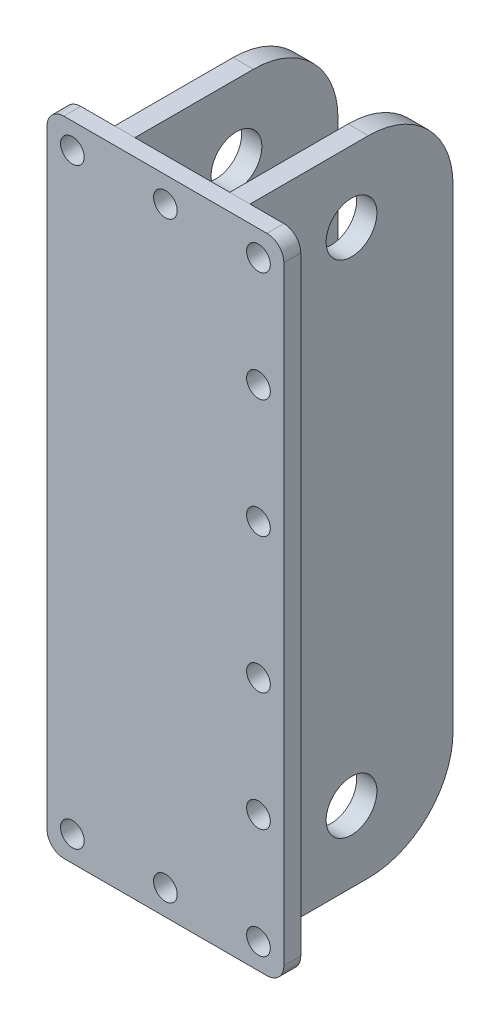
ISO-10303-21;
HEADER;
FILE_DESCRIPTION(('STEP AP214'),'2;1');
FILE_NAME('part.step','',(''),(''),'','','');
FILE_SCHEMA(('AUTOMOTIVE_DESIGN { 1 0 10303 214 1 1 1 1 }'));
ENDSEC;
DATA;
#1=APPLICATION_CONTEXT('core data for automotive mechanical design processes');
#2=APPLICATION_PROTOCOL_DEFINITION('international standard','automotive_design',2000,#1);
#3=PRODUCT_CONTEXT('',#1,'mechanical');
#4=PRODUCT('Part','Part','',(#3));
#5=PRODUCT_RELATED_PRODUCT_CATEGORY('part','',(#4));
#6=PRODUCT_DEFINITION_FORMATION('','',#4);
#7=PRODUCT_DEFINITION_CONTEXT('part definition',#1,'design');
#8=PRODUCT_DEFINITION('design','',#6,#7);
#9=PRODUCT_DEFINITION_SHAPE('','',#8);
#10=(LENGTH_UNIT() NAMED_UNIT(*) SI_UNIT(.MILLI.,.METRE.));
#11=(NAMED_UNIT(*) PLANE_ANGLE_UNIT() SI_UNIT($,.RADIAN.));
#12=(NAMED_UNIT(*) SI_UNIT($,.STERADIAN.) SOLID_ANGLE_UNIT());
#13=UNCERTAINTY_MEASURE_WITH_UNIT(LENGTH_MEASURE(1.E-05),#10,'distance_accuracy_value','');
#14=(GEOMETRIC_REPRESENTATION_CONTEXT(3) GLOBAL_UNCERTAINTY_ASSIGNED_CONTEXT((#13)) GLOBAL_UNIT_ASSIGNED_CONTEXT((#10,
#11,#12)) REPRESENTATION_CONTEXT('',''));
#15=CARTESIAN_POINT('',(0.,0.,0.));
#16=DIRECTION('',(0.,0.,1.));
#17=DIRECTION('',(1.,0.,0.));
#18=AXIS2_PLACEMENT_3D('',#15,#16,#17);
#19=CARTESIAN_POINT('',(42.,380.,-120.));
#20=DIRECTION('',(-1.,0.,0.));
#21=DIRECTION('',(0.,-1.,0.));
#22=AXIS2_PLACEMENT_3D('',#19,#20,#21);
#23=PLANE('',#22);
#24=CARTESIAN_POINT('',(42.,338.,-60.));
#25=DIRECTION('',(-1.,0.,0.));
#26=DIRECTION('',(0.,-1.,0.));
#27=AXIS2_PLACEMENT_3D('',#24,#25,#26);
#28=CIRCLE('',#27,15.);
#29=CARTESIAN_POINT('',(42.,323.,-60.));
#30=VERTEX_POINT('',#29);
#31=EDGE_CURVE('E116',#30,#30,#28,.F.);
#32=ORIENTED_EDGE('',*,*,#31,.F.);
#33=EDGE_LOOP('',(#32));
#34=FACE_BOUND('',#33,.T.);
#35=CARTESIAN_POINT('',(41.9999999999999,42.,-59.9999999999999));
#36=DIRECTION('',(-1.,0.,0.));
#37=DIRECTION('',(0.,-1.,0.));
#38=AXIS2_PLACEMENT_3D('',#35,#36,#37);
#39=CIRCLE('',#38,15.);
#40=CARTESIAN_POINT('',(41.9999999999999,27.,-59.9999999999999));
#41=VERTEX_POINT('',#40);
#42=EDGE_CURVE('E199',#41,#41,#39,.F.);
#43=ORIENTED_EDGE('',*,*,#42,.F.);
#44=EDGE_LOOP('',(#43));
#45=FACE_BOUND('',#44,.T.);
#46=DIRECTION('',(0.,0.,1.));
#47=VECTOR('',#46,1.);
#48=CARTESIAN_POINT('',(41.9999999999999,0.,-120.));
#49=LINE('',#48,#47);
#50=CARTESIAN_POINT('',(41.9999999999999,0.,-70.));
#51=VERTEX_POINT('',#50);
#52=CARTESIAN_POINT('',(41.9999999999999,0.,0.));
#53=VERTEX_POINT('',#52);
#54=EDGE_CURVE('E96',#51,#53,#49,.T.);
#55=ORIENTED_EDGE('',*,*,#54,.F.);
#56=CARTESIAN_POINT('',(42.,50.,-70.));
#57=DIRECTION('',(-1.,0.,0.));
#58=DIRECTION('',(0.,-1.,0.));
#59=AXIS2_PLACEMENT_3D('',#56,#57,#58);
#60=CIRCLE('',#59,50.);
#61=CARTESIAN_POINT('',(42.,50.,-120.));
#62=VERTEX_POINT('',#61);
#63=EDGE_CURVE('E53',#51,#62,#60,.F.);
#64=ORIENTED_EDGE('',*,*,#63,.T.);
#65=DIRECTION('',(0.,-1.,0.));
#66=VECTOR('',#65,1.);
#67=CARTESIAN_POINT('',(42.,380.,-120.));
#68=LINE('',#67,#66);
#69=CARTESIAN_POINT('',(42.,330.,-120.));
#70=VERTEX_POINT('',#69);
#71=EDGE_CURVE('E128',#70,#62,#68,.T.);
#72=ORIENTED_EDGE('',*,*,#71,.F.);
#73=CARTESIAN_POINT('',(42.,330.,-70.));
#74=DIRECTION('',(-1.,0.,0.));
#75=DIRECTION('',(0.,-1.,0.));
#76=AXIS2_PLACEMENT_3D('',#73,#74,#75);
#77=CIRCLE('',#76,50.);
#78=CARTESIAN_POINT('',(42.,380.,-70.));
#79=VERTEX_POINT('',#78);
#80=EDGE_CURVE('E60',#70,#79,#77,.F.);
#81=ORIENTED_EDGE('',*,*,#80,.T.);
#82=DIRECTION('',(0.,0.,1.));
#83=VECTOR('',#82,1.);
#84=CARTESIAN_POINT('',(42.,380.,-120.));
#85=LINE('',#84,#83);
#86=CARTESIAN_POINT('',(42.,380.,0.));
#87=VERTEX_POINT('',#86);
#88=EDGE_CURVE('E114',#79,#87,#85,.T.);
#89=ORIENTED_EDGE('',*,*,#88,.T.);
#90=DIRECTION('',(0.,-1.,0.));
#91=VECTOR('',#90,1.);
#92=CARTESIAN_POINT('',(42.,380.,0.));
#93=LINE('',#92,#91);
#94=EDGE_CURVE('E110',#87,#53,#93,.T.);
#95=ORIENTED_EDGE('',*,*,#94,.T.);
#96=EDGE_LOOP('',(#55,#64,#72,#81,#89,#95));
#97=FACE_BOUND('',#96,.T.);
#98=ADVANCED_FACE('F45',(#34,#45,#97),#23,.F.);
#99=CARTESIAN_POINT('',(41.9999999999999,0.,-120.));
#100=DIRECTION('',(0.,1.,0.));
#101=DIRECTION('',(-1.,0.,0.));
#102=AXIS2_PLACEMENT_3D('',#99,#100,#101);
#103=PLANE('',#102);
#104=DIRECTION('',(0.,0.,1.));
#105=VECTOR('',#104,1.);
#106=CARTESIAN_POINT('',(30.,0.,-120.));
#107=LINE('',#106,#105);
#108=CARTESIAN_POINT('',(30.,0.,-70.));
#109=VERTEX_POINT('',#108);
#110=CARTESIAN_POINT('',(30.,0.,0.));
#111=VERTEX_POINT('',#110);
#112=EDGE_CURVE('E104',#109,#111,#107,.T.);
#113=ORIENTED_EDGE('',*,*,#112,.F.);
#114=DIRECTION('',(-1.,0.,0.));
#115=VECTOR('',#114,1.);
#116=CARTESIAN_POINT('',(41.9999999999999,0.,-70.));
#117=LINE('',#116,#115);
#118=EDGE_CURVE('E68',#109,#51,#117,.F.);
#119=ORIENTED_EDGE('',*,*,#118,.T.);
#120=ORIENTED_EDGE('',*,*,#54,.T.);
#121=DIRECTION('',(-1.,0.,0.));
#122=VECTOR('',#121,1.);
#123=CARTESIAN_POINT('',(41.9999999999999,0.,0.));
#124=LINE('',#123,#122);
#125=EDGE_CURVE('E99',#53,#111,#124,.T.);
#126=ORIENTED_EDGE('',*,*,#125,.T.);
#127=EDGE_LOOP('',(#113,#119,#120,#126));
#128=FACE_BOUND('',#127,.T.);
#129=ADVANCED_FACE('F98',(#128),#103,.F.);
#130=CARTESIAN_POINT('',(30.,380.,-120.));
#131=DIRECTION('',(1.,0.,0.));
#132=DIRECTION('',(0.,1.,0.));
#133=AXIS2_PLACEMENT_3D('',#130,#131,#132);
#134=PLANE('',#133);
#135=CARTESIAN_POINT('',(30.,338.,-60.));
#136=DIRECTION('',(-1.,0.,0.));
#137=DIRECTION('',(0.,-1.,0.));
#138=AXIS2_PLACEMENT_3D('',#135,#136,#137);
#139=CIRCLE('',#138,15.);
#140=CARTESIAN_POINT('',(30.,323.,-60.));
#141=VERTEX_POINT('',#140);
#142=EDGE_CURVE('E119',#141,#141,#139,.T.);
#143=ORIENTED_EDGE('',*,*,#142,.F.);
#144=EDGE_LOOP('',(#143));
#145=FACE_BOUND('',#144,.T.);
#146=CARTESIAN_POINT('',(30.,42.,-59.9999999999999));
#147=DIRECTION('',(-1.,0.,0.));
#148=DIRECTION('',(0.,-1.,0.));
#149=AXIS2_PLACEMENT_3D('',#146,#147,#148);
#150=CIRCLE('',#149,15.);
#151=CARTESIAN_POINT('',(30.,27.,-59.9999999999999));
#152=VERTEX_POINT('',#151);
#153=EDGE_CURVE('E202',#152,#152,#150,.T.);
#154=ORIENTED_EDGE('',*,*,#153,.F.);
#155=EDGE_LOOP('',(#154));
#156=FACE_BOUND('',#155,.T.);
#157=DIRECTION('',(0.,1.,0.));
#158=VECTOR('',#157,1.);
#159=CARTESIAN_POINT('',(30.,380.,-120.));
#160=LINE('',#159,#158);
#161=CARTESIAN_POINT('',(30.,50.,-120.));
#162=VERTEX_POINT('',#161);
#163=CARTESIAN_POINT('',(30.,330.,-120.));
#164=VERTEX_POINT('',#163);
#165=EDGE_CURVE('E122',#162,#164,#160,.T.);
#166=ORIENTED_EDGE('',*,*,#165,.F.);
#167=CARTESIAN_POINT('',(30.,50.,-70.));
#168=DIRECTION('',(1.,0.,0.));
#169=DIRECTION('',(0.,1.,0.));
#170=AXIS2_PLACEMENT_3D('',#167,#168,#169);
#171=CIRCLE('',#170,50.);
#172=EDGE_CURVE('E140',#162,#109,#171,.F.);
#173=ORIENTED_EDGE('',*,*,#172,.T.);
#174=ORIENTED_EDGE('',*,*,#112,.T.);
#175=DIRECTION('',(0.,1.,0.));
#176=VECTOR('',#175,1.);
#177=CARTESIAN_POINT('',(30.,380.,0.));
#178=LINE('',#177,#176);
#179=CARTESIAN_POINT('',(30.,380.,0.));
#180=VERTEX_POINT('',#179);
#181=EDGE_CURVE('E112',#111,#180,#178,.T.);
#182=ORIENTED_EDGE('',*,*,#181,.T.);
#183=DIRECTION('',(0.,0.,1.));
#184=VECTOR('',#183,1.);
#185=CARTESIAN_POINT('',(30.,380.,-120.));
#186=LINE('',#185,#184);
#187=CARTESIAN_POINT('',(30.,380.,-70.));
#188=VERTEX_POINT('',#187);
#189=EDGE_CURVE('E130',#188,#180,#186,.T.);
#190=ORIENTED_EDGE('',*,*,#189,.F.);
#191=CARTESIAN_POINT('',(30.,330.,-70.));
#192=DIRECTION('',(1.,0.,0.));
#193=DIRECTION('',(0.,1.,0.));
#194=AXIS2_PLACEMENT_3D('',#191,#192,#193);
#195=CIRCLE('',#194,50.);
#196=EDGE_CURVE('E138',#188,#164,#195,.F.);
#197=ORIENTED_EDGE('',*,*,#196,.T.);
#198=EDGE_LOOP('',(#166,#173,#174,#182,#190,#197));
#199=FACE_BOUND('',#198,.T.);
#200=ADVANCED_FACE('F153',(#145,#156,#199),#134,.F.);
#201=CARTESIAN_POINT('',(42.,380.,-120.));
#202=DIRECTION('',(0.,-1.,0.));
#203=DIRECTION('',(0.,0.,-1.));
#204=AXIS2_PLACEMENT_3D('',#201,#202,#203);
#205=PLANE('',#204);
#206=ORIENTED_EDGE('',*,*,#88,.F.);
#207=DIRECTION('',(1.,0.,0.));
#208=VECTOR('',#207,1.);
#209=CARTESIAN_POINT('',(30.,380.,-70.));
#210=LINE('',#209,#208);
#211=EDGE_CURVE('E12',#79,#188,#210,.F.);
#212=ORIENTED_EDGE('',*,*,#211,.T.);
#213=ORIENTED_EDGE('',*,*,#189,.T.);
#214=DIRECTION('',(1.,0.,0.));
#215=VECTOR('',#214,1.);
#216=CARTESIAN_POINT('',(42.,380.,0.));
#217=LINE('',#216,#215);
#218=EDGE_CURVE('E126',#180,#87,#217,.T.);
#219=ORIENTED_EDGE('',*,*,#218,.T.);
#220=EDGE_LOOP('',(#206,#212,#213,#219));
#221=FACE_BOUND('',#220,.T.);
#222=ADVANCED_FACE('F159',(#221),#205,.F.);
#223=CARTESIAN_POINT('',(0.,0.,-120.));
#224=DIRECTION('',(0.,0.,-1.));
#225=DIRECTION('',(-1.,0.,0.));
#226=AXIS2_PLACEMENT_3D('',#223,#224,#225);
#227=PLANE('',#226);
#228=ORIENTED_EDGE('',*,*,#71,.T.);
#229=DIRECTION('',(-1.,0.,0.));
#230=VECTOR('',#229,1.);
#231=CARTESIAN_POINT('',(30.,50.,-120.));
#232=LINE('',#231,#230);
#233=EDGE_CURVE('E135',#62,#162,#232,.T.);
#234=ORIENTED_EDGE('',*,*,#233,.T.);
#235=ORIENTED_EDGE('',*,*,#165,.T.);
#236=DIRECTION('',(1.,0.,0.));
#237=VECTOR('',#236,1.);
#238=CARTESIAN_POINT('',(42.,330.,-120.));
#239=LINE('',#238,#237);
#240=EDGE_CURVE('E103',#164,#70,#239,.T.);
#241=ORIENTED_EDGE('',*,*,#240,.T.);
#242=EDGE_LOOP('',(#228,#234,#235,#241));
#243=FACE_BOUND('',#242,.T.);
#244=ADVANCED_FACE('F147',(#243),#227,.T.);
#245=CARTESIAN_POINT('',(0.,0.,0.));
#246=DIRECTION('',(0.,0.,-1.));
#247=DIRECTION('',(-1.,0.,0.));
#248=AXIS2_PLACEMENT_3D('',#245,#246,#247);
#249=PLANE('',#248);
#250=ORIENTED_EDGE('',*,*,#94,.F.);
#251=ORIENTED_EDGE('',*,*,#218,.F.);
#252=ORIENTED_EDGE('',*,*,#181,.F.);
#253=ORIENTED_EDGE('',*,*,#125,.F.);
#254=EDGE_LOOP('',(#250,#251,#252,#253));
#255=FACE_BOUND('',#254,.T.);
#256=ADVANCED_FACE('F108',(#255),#249,.F.);
#257=CARTESIAN_POINT('',(0.,50.,-70.));
#258=DIRECTION('',(1.,0.,0.));
#259=DIRECTION('',(0.,1.,0.));
#260=AXIS2_PLACEMENT_3D('',#257,#258,#259);
#261=CYLINDRICAL_SURFACE('',#260,50.);
#262=ORIENTED_EDGE('',*,*,#63,.F.);
#263=ORIENTED_EDGE('',*,*,#118,.F.);
#264=ORIENTED_EDGE('',*,*,#172,.F.);
#265=ORIENTED_EDGE('',*,*,#233,.F.);
#266=EDGE_LOOP('',(#262,#263,#264,#265));
#267=FACE_BOUND('',#266,.T.);
#268=ADVANCED_FACE('F151',(#267),#261,.T.);
#269=CARTESIAN_POINT('',(0.,330.,-70.));
#270=DIRECTION('',(-1.,0.,0.));
#271=DIRECTION('',(0.,0.,1.));
#272=AXIS2_PLACEMENT_3D('',#269,#270,#271);
#273=CYLINDRICAL_SURFACE('',#272,50.);
#274=ORIENTED_EDGE('',*,*,#196,.F.);
#275=ORIENTED_EDGE('',*,*,#211,.F.);
#276=ORIENTED_EDGE('',*,*,#80,.F.);
#277=ORIENTED_EDGE('',*,*,#240,.F.);
#278=EDGE_LOOP('',(#274,#275,#276,#277));
#279=FACE_BOUND('',#278,.T.);
#280=ADVANCED_FACE('F47',(#279),#273,.T.);
#281=CARTESIAN_POINT('',(140.001,42.,-59.9999999999999));
#282=DIRECTION('',(-1.,0.,0.));
#283=DIRECTION('',(0.,-1.,0.));
#284=AXIS2_PLACEMENT_3D('',#281,#282,#283);
#285=CYLINDRICAL_SURFACE('',#284,15.);
#286=ORIENTED_EDGE('',*,*,#153,.T.);
#287=EDGE_LOOP('',(#286));
#288=FACE_BOUND('',#287,.T.);
#289=ORIENTED_EDGE('',*,*,#42,.T.);
#290=EDGE_LOOP('',(#289));
#291=FACE_BOUND('',#290,.T.);
#292=ADVANCED_FACE('F184',(#288,#291),#285,.F.);
#293=CARTESIAN_POINT('',(140.001,338.,-60.));
#294=DIRECTION('',(-1.,0.,0.));
#295=DIRECTION('',(0.,-1.,0.));
#296=AXIS2_PLACEMENT_3D('',#293,#294,#295);
#297=CYLINDRICAL_SURFACE('',#296,15.);
#298=ORIENTED_EDGE('',*,*,#142,.T.);
#299=EDGE_LOOP('',(#298));
#300=FACE_BOUND('',#299,.T.);
#301=ORIENTED_EDGE('',*,*,#31,.T.);
#302=EDGE_LOOP('',(#301));
#303=FACE_BOUND('',#302,.T.);
#304=ADVANCED_FACE('F190',(#300,#303),#297,.F.);
#305=CLOSED_SHELL('',(#98,#129,#200,#222,#244,#256,#268,#280,#292,#304));
#306=MANIFOLD_SOLID_BREP('B2',#305);
#307=CARTESIAN_POINT('',(110.,380.,-120.));
#308=DIRECTION('',(-1.,0.,0.));
#309=DIRECTION('',(0.,-1.,0.));
#310=AXIS2_PLACEMENT_3D('',#307,#308,#309);
#311=PLANE('',#310);
#312=CARTESIAN_POINT('',(110.,338.,-60.));
#313=DIRECTION('',(1.,0.,0.));
#314=DIRECTION('',(0.,1.,0.));
#315=AXIS2_PLACEMENT_3D('',#312,#313,#314);
#316=CIRCLE('',#315,15.);
#317=CARTESIAN_POINT('',(110.,353.,-60.));
#318=VERTEX_POINT('',#317);
#319=EDGE_CURVE('E350',#318,#318,#316,.T.);
#320=ORIENTED_EDGE('',*,*,#319,.F.);
#321=EDGE_LOOP('',(#320));
#322=FACE_BOUND('',#321,.T.);
#323=CARTESIAN_POINT('',(110.,42.,-60.0000000000001));
#324=DIRECTION('',(1.,0.,0.));
#325=DIRECTION('',(0.,1.,0.));
#326=AXIS2_PLACEMENT_3D('',#323,#324,#325);
#327=CIRCLE('',#326,15.);
#328=CARTESIAN_POINT('',(110.,57.,-60.0000000000001));
#329=VERTEX_POINT('',#328);
#330=EDGE_CURVE('E390',#329,#329,#327,.T.);
#331=ORIENTED_EDGE('',*,*,#330,.F.);
#332=EDGE_LOOP('',(#331));
#333=FACE_BOUND('',#332,.T.);
#334=DIRECTION('',(0.,-1.,0.));
#335=VECTOR('',#334,1.);
#336=CARTESIAN_POINT('',(110.,380.,-120.));
#337=LINE('',#336,#335);
#338=CARTESIAN_POINT('',(110.,330.,-120.));
#339=VERTEX_POINT('',#338);
#340=CARTESIAN_POINT('',(110.,50.,-120.));
#341=VERTEX_POINT('',#340);
#342=EDGE_CURVE('E359',#339,#341,#337,.T.);
#343=ORIENTED_EDGE('',*,*,#342,.F.);
#344=CARTESIAN_POINT('',(110.,330.,-70.));
#345=DIRECTION('',(-1.,0.,0.));
#346=DIRECTION('',(0.,-1.,0.));
#347=AXIS2_PLACEMENT_3D('',#344,#345,#346);
#348=CIRCLE('',#347,50.);
#349=CARTESIAN_POINT('',(110.,380.,-70.));
#350=VERTEX_POINT('',#349);
#351=EDGE_CURVE('E371',#339,#350,#348,.F.);
#352=ORIENTED_EDGE('',*,*,#351,.T.);
#353=DIRECTION('',(0.,0.,1.));
#354=VECTOR('',#353,1.);
#355=CARTESIAN_POINT('',(110.,380.,-120.));
#356=LINE('',#355,#354);
#357=CARTESIAN_POINT('',(110.,380.,0.));
#358=VERTEX_POINT('',#357);
#359=EDGE_CURVE('E345',#350,#358,#356,.T.);
#360=ORIENTED_EDGE('',*,*,#359,.T.);
#361=DIRECTION('',(0.,-1.,0.));
#362=VECTOR('',#361,1.);
#363=CARTESIAN_POINT('',(110.,380.,0.));
#364=LINE('',#363,#362);
#365=CARTESIAN_POINT('',(110.,0.,0.));
#366=VERTEX_POINT('',#365);
#367=EDGE_CURVE('E340',#358,#366,#364,.T.);
#368=ORIENTED_EDGE('',*,*,#367,.T.);
#369=DIRECTION('',(0.,0.,1.));
#370=VECTOR('',#369,1.);
#371=CARTESIAN_POINT('',(110.,0.,-120.));
#372=LINE('',#371,#370);
#373=CARTESIAN_POINT('',(110.,0.,-70.));
#374=VERTEX_POINT('',#373);
#375=EDGE_CURVE('E324',#374,#366,#372,.T.);
#376=ORIENTED_EDGE('',*,*,#375,.F.);
#377=CARTESIAN_POINT('',(110.,50.,-70.));
#378=DIRECTION('',(-1.,0.,0.));
#379=DIRECTION('',(0.,-1.,0.));
#380=AXIS2_PLACEMENT_3D('',#377,#378,#379);
#381=CIRCLE('',#380,50.);
#382=EDGE_CURVE('E369',#374,#341,#381,.F.);
#383=ORIENTED_EDGE('',*,*,#382,.T.);
#384=EDGE_LOOP('',(#343,#352,#360,#368,#376,#383));
#385=FACE_BOUND('',#384,.T.);
#386=ADVANCED_FACE('F271',(#322,#333,#385),#311,.F.);
#387=CARTESIAN_POINT('',(110.,0.,-120.));
#388=DIRECTION('',(0.,1.,0.));
#389=DIRECTION('',(0.,0.,1.));
#390=AXIS2_PLACEMENT_3D('',#387,#388,#389);
#391=PLANE('',#390);
#392=DIRECTION('',(0.,0.,1.));
#393=VECTOR('',#392,1.);
#394=CARTESIAN_POINT('',(98.,0.,-120.));
#395=LINE('',#394,#393);
#396=CARTESIAN_POINT('',(98.,0.,-70.));
#397=VERTEX_POINT('',#396);
#398=CARTESIAN_POINT('',(98.,0.,0.));
#399=VERTEX_POINT('',#398);
#400=EDGE_CURVE('E334',#397,#399,#395,.T.);
#401=ORIENTED_EDGE('',*,*,#400,.F.);
#402=DIRECTION('',(-1.,0.,0.));
#403=VECTOR('',#402,1.);
#404=CARTESIAN_POINT('',(110.,0.,-70.));
#405=LINE('',#404,#403);
#406=EDGE_CURVE('E43',#397,#374,#405,.F.);
#407=ORIENTED_EDGE('',*,*,#406,.T.);
#408=ORIENTED_EDGE('',*,*,#375,.T.);
#409=DIRECTION('',(-1.,0.,0.));
#410=VECTOR('',#409,1.);
#411=CARTESIAN_POINT('',(110.,0.,0.));
#412=LINE('',#411,#410);
#413=EDGE_CURVE('E327',#366,#399,#412,.T.);
#414=ORIENTED_EDGE('',*,*,#413,.T.);
#415=EDGE_LOOP('',(#401,#407,#408,#414));
#416=FACE_BOUND('',#415,.T.);
#417=ADVANCED_FACE('F326',(#416),#391,.F.);
#418=CARTESIAN_POINT('',(98.,380.,-120.));
#419=DIRECTION('',(1.,0.,0.));
#420=DIRECTION('',(0.,1.,0.));
#421=AXIS2_PLACEMENT_3D('',#418,#419,#420);
#422=PLANE('',#421);
#423=CARTESIAN_POINT('',(98.,338.,-60.));
#424=DIRECTION('',(1.,0.,0.));
#425=DIRECTION('',(0.,1.,0.));
#426=AXIS2_PLACEMENT_3D('',#423,#424,#425);
#427=CIRCLE('',#426,15.);
#428=CARTESIAN_POINT('',(98.,353.,-60.));
#429=VERTEX_POINT('',#428);
#430=EDGE_CURVE('E347',#429,#429,#427,.F.);
#431=ORIENTED_EDGE('',*,*,#430,.F.);
#432=EDGE_LOOP('',(#431));
#433=FACE_BOUND('',#432,.T.);
#434=CARTESIAN_POINT('',(98.,42.,-60.0000000000001));
#435=DIRECTION('',(1.,0.,0.));
#436=DIRECTION('',(0.,1.,0.));
#437=AXIS2_PLACEMENT_3D('',#434,#435,#436);
#438=CIRCLE('',#437,15.);
#439=CARTESIAN_POINT('',(98.,57.,-60.0000000000001));
#440=VERTEX_POINT('',#439);
#441=EDGE_CURVE('E387',#440,#440,#438,.F.);
#442=ORIENTED_EDGE('',*,*,#441,.F.);
#443=EDGE_LOOP('',(#442));
#444=FACE_BOUND('',#443,.T.);
#445=DIRECTION('',(0.,0.,1.));
#446=VECTOR('',#445,1.);
#447=CARTESIAN_POINT('',(98.,380.,-120.));
#448=LINE('',#447,#446);
#449=CARTESIAN_POINT('',(98.,380.,-70.));
#450=VERTEX_POINT('',#449);
#451=CARTESIAN_POINT('',(98.,380.,0.));
#452=VERTEX_POINT('',#451);
#453=EDGE_CURVE('E361',#450,#452,#448,.T.);
#454=ORIENTED_EDGE('',*,*,#453,.F.);
#455=CARTESIAN_POINT('',(98.,330.,-70.));
#456=DIRECTION('',(1.,0.,0.));
#457=DIRECTION('',(0.,1.,0.));
#458=AXIS2_PLACEMENT_3D('',#455,#456,#457);
#459=CIRCLE('',#458,50.);
#460=CARTESIAN_POINT('',(98.,330.,-120.));
#461=VERTEX_POINT('',#460);
#462=EDGE_CURVE('E279',#450,#461,#459,.F.);
#463=ORIENTED_EDGE('',*,*,#462,.T.);
#464=DIRECTION('',(0.,1.,0.));
#465=VECTOR('',#464,1.);
#466=CARTESIAN_POINT('',(98.,380.,-120.));
#467=LINE('',#466,#465);
#468=CARTESIAN_POINT('',(98.,50.,-120.));
#469=VERTEX_POINT('',#468);
#470=EDGE_CURVE('E353',#469,#461,#467,.T.);
#471=ORIENTED_EDGE('',*,*,#470,.F.);
#472=CARTESIAN_POINT('',(98.,50.,-70.));
#473=DIRECTION('',(1.,0.,0.));
#474=DIRECTION('',(0.,1.,0.));
#475=AXIS2_PLACEMENT_3D('',#472,#473,#474);
#476=CIRCLE('',#475,50.);
#477=EDGE_CURVE('E286',#469,#397,#476,.F.);
#478=ORIENTED_EDGE('',*,*,#477,.T.);
#479=ORIENTED_EDGE('',*,*,#400,.T.);
#480=DIRECTION('',(0.,1.,0.));
#481=VECTOR('',#480,1.);
#482=CARTESIAN_POINT('',(98.,380.,0.));
#483=LINE('',#482,#481);
#484=EDGE_CURVE('E342',#399,#452,#483,.T.);
#485=ORIENTED_EDGE('',*,*,#484,.T.);
#486=EDGE_LOOP('',(#454,#463,#471,#478,#479,#485));
#487=FACE_BOUND('',#486,.T.);
#488=ADVANCED_FACE('F376',(#433,#444,#487),#422,.F.);
#489=CARTESIAN_POINT('',(110.,380.,-120.));
#490=DIRECTION('',(0.,-1.,0.));
#491=DIRECTION('',(0.,0.,-1.));
#492=AXIS2_PLACEMENT_3D('',#489,#490,#491);
#493=PLANE('',#492);
#494=ORIENTED_EDGE('',*,*,#359,.F.);
#495=DIRECTION('',(1.,0.,0.));
#496=VECTOR('',#495,1.);
#497=CARTESIAN_POINT('',(98.,380.,-70.));
#498=LINE('',#497,#496);
#499=EDGE_CURVE('E294',#350,#450,#498,.F.);
#500=ORIENTED_EDGE('',*,*,#499,.T.);
#501=ORIENTED_EDGE('',*,*,#453,.T.);
#502=DIRECTION('',(1.,0.,0.));
#503=VECTOR('',#502,1.);
#504=CARTESIAN_POINT('',(110.,380.,0.));
#505=LINE('',#504,#503);
#506=EDGE_CURVE('E357',#452,#358,#505,.T.);
#507=ORIENTED_EDGE('',*,*,#506,.T.);
#508=EDGE_LOOP('',(#494,#500,#501,#507));
#509=FACE_BOUND('',#508,.T.);
#510=ADVANCED_FACE('F384',(#509),#493,.F.);
#511=CARTESIAN_POINT('',(0.,0.,-120.));
#512=DIRECTION('',(0.,0.,-1.));
#513=DIRECTION('',(-1.,0.,0.));
#514=AXIS2_PLACEMENT_3D('',#511,#512,#513);
#515=PLANE('',#514);
#516=ORIENTED_EDGE('',*,*,#470,.T.);
#517=DIRECTION('',(1.,0.,0.));
#518=VECTOR('',#517,1.);
#519=CARTESIAN_POINT('',(110.,330.,-120.));
#520=LINE('',#519,#518);
#521=EDGE_CURVE('E366',#461,#339,#520,.T.);
#522=ORIENTED_EDGE('',*,*,#521,.T.);
#523=ORIENTED_EDGE('',*,*,#342,.T.);
#524=DIRECTION('',(-1.,0.,0.));
#525=VECTOR('',#524,1.);
#526=CARTESIAN_POINT('',(98.,50.,-120.));
#527=LINE('',#526,#525);
#528=EDGE_CURVE('E333',#341,#469,#527,.T.);
#529=ORIENTED_EDGE('',*,*,#528,.T.);
#530=EDGE_LOOP('',(#516,#522,#523,#529));
#531=FACE_BOUND('',#530,.T.);
#532=ADVANCED_FACE('F380',(#531),#515,.T.);
#533=CARTESIAN_POINT('',(0.,0.,0.));
#534=DIRECTION('',(0.,0.,-1.));
#535=DIRECTION('',(-1.,0.,0.));
#536=AXIS2_PLACEMENT_3D('',#533,#534,#535);
#537=PLANE('',#536);
#538=ORIENTED_EDGE('',*,*,#367,.F.);
#539=ORIENTED_EDGE('',*,*,#506,.F.);
#540=ORIENTED_EDGE('',*,*,#484,.F.);
#541=ORIENTED_EDGE('',*,*,#413,.F.);
#542=EDGE_LOOP('',(#538,#539,#540,#541));
#543=FACE_BOUND('',#542,.T.);
#544=ADVANCED_FACE('F338',(#543),#537,.F.);
#545=CARTESIAN_POINT('',(0.,330.,-70.));
#546=DIRECTION('',(-1.,0.,0.));
#547=DIRECTION('',(0.,0.,1.));
#548=AXIS2_PLACEMENT_3D('',#545,#546,#547);
#549=CYLINDRICAL_SURFACE('',#548,50.);
#550=ORIENTED_EDGE('',*,*,#462,.F.);
#551=ORIENTED_EDGE('',*,*,#499,.F.);
#552=ORIENTED_EDGE('',*,*,#351,.F.);
#553=ORIENTED_EDGE('',*,*,#521,.F.);
#554=EDGE_LOOP('',(#550,#551,#552,#553));
#555=FACE_BOUND('',#554,.T.);
#556=ADVANCED_FACE('F383',(#555),#549,.T.);
#557=CARTESIAN_POINT('',(0.,50.,-70.));
#558=DIRECTION('',(1.,0.,0.));
#559=DIRECTION('',(0.,0.,-1.));
#560=AXIS2_PLACEMENT_3D('',#557,#558,#559);
#561=CYLINDRICAL_SURFACE('',#560,50.);
#562=ORIENTED_EDGE('',*,*,#382,.F.);
#563=ORIENTED_EDGE('',*,*,#406,.F.);
#564=ORIENTED_EDGE('',*,*,#477,.F.);
#565=ORIENTED_EDGE('',*,*,#528,.F.);
#566=EDGE_LOOP('',(#562,#563,#564,#565));
#567=FACE_BOUND('',#566,.T.);
#568=ADVANCED_FACE('F273',(#567),#561,.T.);
#569=CARTESIAN_POINT('',(-0.00100000000004263,42.,-60.0000000000001));
#570=DIRECTION('',(1.,0.,0.));
#571=DIRECTION('',(0.,1.,0.));
#572=AXIS2_PLACEMENT_3D('',#569,#570,#571);
#573=CYLINDRICAL_SURFACE('',#572,15.);
#574=ORIENTED_EDGE('',*,*,#330,.T.);
#575=EDGE_LOOP('',(#574));
#576=FACE_BOUND('',#575,.T.);
#577=ORIENTED_EDGE('',*,*,#441,.T.);
#578=EDGE_LOOP('',(#577));
#579=FACE_BOUND('',#578,.T.);
#580=ADVANCED_FACE('F404',(#576,#579),#573,.F.);
#581=CARTESIAN_POINT('',(-0.001000000000001,338.,-60.));
#582=DIRECTION('',(1.,0.,0.));
#583=DIRECTION('',(0.,1.,0.));
#584=AXIS2_PLACEMENT_3D('',#581,#582,#583);
#585=CYLINDRICAL_SURFACE('',#584,15.);
#586=ORIENTED_EDGE('',*,*,#319,.T.);
#587=EDGE_LOOP('',(#586));
#588=FACE_BOUND('',#587,.T.);
#589=ORIENTED_EDGE('',*,*,#430,.T.);
#590=EDGE_LOOP('',(#589));
#591=FACE_BOUND('',#590,.T.);
#592=ADVANCED_FACE('F396',(#588,#591),#585,.F.);
#593=CLOSED_SHELL('',(#386,#417,#488,#510,#532,#544,#556,#568,#580,#592));
#594=MANIFOLD_SOLID_BREP('B6',#593);
#595=CARTESIAN_POINT('',(130.,10.,10.));
#596=DIRECTION('',(0.,0.,-1.));
#597=DIRECTION('',(-1.,0.,0.));
#598=AXIS2_PLACEMENT_3D('',#595,#596,#597);
#599=CYLINDRICAL_SURFACE('',#598,10.);
#600=CARTESIAN_POINT('',(130.,10.,0.));
#601=DIRECTION('',(0.,0.,1.));
#602=DIRECTION('',(1.,0.,0.));
#603=AXIS2_PLACEMENT_3D('',#600,#601,#602);
#604=CIRCLE('',#603,10.);
#605=CARTESIAN_POINT('',(130.,0.,0.));
#606=VERTEX_POINT('',#605);
#607=CARTESIAN_POINT('',(140.,10.,0.));
#608=VERTEX_POINT('',#607);
#609=EDGE_CURVE('E584',#606,#608,#604,.T.);
#610=ORIENTED_EDGE('',*,*,#609,.T.);
#611=DIRECTION('',(0.,0.,-1.));
#612=VECTOR('',#611,1.);
#613=CARTESIAN_POINT('',(140.,10.,10.));
#614=LINE('',#613,#612);
#615=CARTESIAN_POINT('',(140.,10.,10.));
#616=VERTEX_POINT('',#615);
#617=EDGE_CURVE('E269',#616,#608,#614,.T.);
#618=ORIENTED_EDGE('',*,*,#617,.F.);
#619=CARTESIAN_POINT('',(130.,10.,10.));
#620=DIRECTION('',(0.,0.,1.));
#621=DIRECTION('',(1.,0.,0.));
#622=AXIS2_PLACEMENT_3D('',#619,#620,#621);
#623=CIRCLE('',#622,10.);
#624=CARTESIAN_POINT('',(130.,0.,10.));
#625=VERTEX_POINT('',#624);
#626=EDGE_CURVE('E599',#625,#616,#623,.T.);
#627=ORIENTED_EDGE('',*,*,#626,.F.);
#628=DIRECTION('',(0.,0.,-1.));
#629=VECTOR('',#628,1.);
#630=CARTESIAN_POINT('',(130.,0.,10.));
#631=LINE('',#630,#629);
#632=EDGE_CURVE('E580',#625,#606,#631,.T.);
#633=ORIENTED_EDGE('',*,*,#632,.T.);
#634=EDGE_LOOP('',(#610,#618,#627,#633));
#635=FACE_BOUND('',#634,.T.);
#636=ADVANCED_FACE('F488',(#635),#599,.T.);
#637=CARTESIAN_POINT('',(140.,10.,10.));
#638=DIRECTION('',(-1.,0.,0.));
#639=DIRECTION('',(0.,0.,1.));
#640=AXIS2_PLACEMENT_3D('',#637,#638,#639);
#641=PLANE('',#640);
#642=DIRECTION('',(0.,1.,0.));
#643=VECTOR('',#642,1.);
#644=CARTESIAN_POINT('',(140.,10.,0.));
#645=LINE('',#644,#643);
#646=CARTESIAN_POINT('',(140.,370.,0.));
#647=VERTEX_POINT('',#646);
#648=EDGE_CURVE('E587',#608,#647,#645,.T.);
#649=ORIENTED_EDGE('',*,*,#648,.T.);
#650=DIRECTION('',(0.,0.,-1.));
#651=VECTOR('',#650,1.);
#652=CARTESIAN_POINT('',(140.,370.,10.));
#653=LINE('',#652,#651);
#654=CARTESIAN_POINT('',(140.,370.,10.));
#655=VERTEX_POINT('',#654);
#656=EDGE_CURVE('E496',#655,#647,#653,.T.);
#657=ORIENTED_EDGE('',*,*,#656,.F.);
#658=DIRECTION('',(0.,1.,0.));
#659=VECTOR('',#658,1.);
#660=CARTESIAN_POINT('',(140.,10.,10.));
#661=LINE('',#660,#659);
#662=EDGE_CURVE('E547',#616,#655,#661,.T.);
#663=ORIENTED_EDGE('',*,*,#662,.F.);
#664=ORIENTED_EDGE('',*,*,#617,.T.);
#665=EDGE_LOOP('',(#649,#657,#663,#664));
#666=FACE_BOUND('',#665,.T.);
#667=ADVANCED_FACE('F717',(#666),#641,.F.);
#668=CARTESIAN_POINT('',(130.,370.,10.));
#669=DIRECTION('',(0.,0.,-1.));
#670=DIRECTION('',(-1.,0.,0.));
#671=AXIS2_PLACEMENT_3D('',#668,#669,#670);
#672=CYLINDRICAL_SURFACE('',#671,10.);
#673=CARTESIAN_POINT('',(130.,370.,0.));
#674=DIRECTION('',(0.,0.,1.));
#675=DIRECTION('',(-1.,0.,0.));
#676=AXIS2_PLACEMENT_3D('',#673,#674,#675);
#677=CIRCLE('',#676,10.);
#678=CARTESIAN_POINT('',(130.,380.,0.));
#679=VERTEX_POINT('',#678);
#680=EDGE_CURVE('E590',#647,#679,#677,.T.);
#681=ORIENTED_EDGE('',*,*,#680,.T.);
#682=DIRECTION('',(0.,0.,-1.));
#683=VECTOR('',#682,1.);
#684=CARTESIAN_POINT('',(130.,380.,10.));
#685=LINE('',#684,#683);
#686=CARTESIAN_POINT('',(130.,380.,10.));
#687=VERTEX_POINT('',#686);
#688=EDGE_CURVE('E606',#687,#679,#685,.T.);
#689=ORIENTED_EDGE('',*,*,#688,.F.);
#690=CARTESIAN_POINT('',(130.,370.,10.));
#691=DIRECTION('',(0.,0.,1.));
#692=DIRECTION('',(-1.,0.,0.));
#693=AXIS2_PLACEMENT_3D('',#690,#691,#692);
#694=CIRCLE('',#693,10.);
#695=EDGE_CURVE('E614',#655,#687,#694,.T.);
#696=ORIENTED_EDGE('',*,*,#695,.F.);
#697=ORIENTED_EDGE('',*,*,#656,.T.);
#698=EDGE_LOOP('',(#681,#689,#696,#697));
#699=FACE_BOUND('',#698,.T.);
#700=ADVANCED_FACE('F612',(#699),#672,.T.);
#701=CARTESIAN_POINT('',(10.,380.,10.));
#702=DIRECTION('',(0.,-1.,0.));
#703=DIRECTION('',(0.,0.,-1.));
#704=AXIS2_PLACEMENT_3D('',#701,#702,#703);
#705=PLANE('',#704);
#706=DIRECTION('',(-1.,0.,0.));
#707=VECTOR('',#706,1.);
#708=CARTESIAN_POINT('',(10.,380.,0.));
#709=LINE('',#708,#707);
#710=CARTESIAN_POINT('',(10.,380.,0.));
#711=VERTEX_POINT('',#710);
#712=EDGE_CURVE('E592',#679,#711,#709,.T.);
#713=ORIENTED_EDGE('',*,*,#712,.T.);
#714=DIRECTION('',(0.,0.,-1.));
#715=VECTOR('',#714,1.);
#716=CARTESIAN_POINT('',(10.,380.,10.));
#717=LINE('',#716,#715);
#718=CARTESIAN_POINT('',(10.,380.,10.));
#719=VERTEX_POINT('',#718);
#720=EDGE_CURVE('E603',#719,#711,#717,.T.);
#721=ORIENTED_EDGE('',*,*,#720,.F.);
#722=DIRECTION('',(-1.,0.,0.));
#723=VECTOR('',#722,1.);
#724=CARTESIAN_POINT('',(10.,380.,10.));
#725=LINE('',#724,#723);
#726=EDGE_CURVE('E626',#687,#719,#725,.T.);
#727=ORIENTED_EDGE('',*,*,#726,.F.);
#728=ORIENTED_EDGE('',*,*,#688,.T.);
#729=EDGE_LOOP('',(#713,#721,#727,#728));
#730=FACE_BOUND('',#729,.T.);
#731=ADVANCED_FACE('F622',(#730),#705,.F.);
#732=CARTESIAN_POINT('',(10.,370.,10.));
#733=DIRECTION('',(0.,0.,-1.));
#734=DIRECTION('',(-1.,0.,0.));
#735=AXIS2_PLACEMENT_3D('',#732,#733,#734);
#736=CYLINDRICAL_SURFACE('',#735,10.);
#737=CARTESIAN_POINT('',(10.,370.,0.));
#738=DIRECTION('',(0.,0.,1.));
#739=DIRECTION('',(-1.,0.,0.));
#740=AXIS2_PLACEMENT_3D('',#737,#738,#739);
#741=CIRCLE('',#740,10.);
#742=CARTESIAN_POINT('',(0.,370.,0.));
#743=VERTEX_POINT('',#742);
#744=EDGE_CURVE('E594',#711,#743,#741,.T.);
#745=ORIENTED_EDGE('',*,*,#744,.T.);
#746=DIRECTION('',(0.,0.,-1.));
#747=VECTOR('',#746,1.);
#748=CARTESIAN_POINT('',(0.,370.,10.));
#749=LINE('',#748,#747);
#750=CARTESIAN_POINT('',(0.,370.,10.));
#751=VERTEX_POINT('',#750);
#752=EDGE_CURVE('E575',#751,#743,#749,.T.);
#753=ORIENTED_EDGE('',*,*,#752,.F.);
#754=CARTESIAN_POINT('',(10.,370.,10.));
#755=DIRECTION('',(0.,0.,1.));
#756=DIRECTION('',(-1.,0.,0.));
#757=AXIS2_PLACEMENT_3D('',#754,#755,#756);
#758=CIRCLE('',#757,10.);
#759=EDGE_CURVE('E566',#719,#751,#758,.T.);
#760=ORIENTED_EDGE('',*,*,#759,.F.);
#761=ORIENTED_EDGE('',*,*,#720,.T.);
#762=EDGE_LOOP('',(#745,#753,#760,#761));
#763=FACE_BOUND('',#762,.T.);
#764=ADVANCED_FACE('F625',(#763),#736,.T.);
#765=CARTESIAN_POINT('',(0.,10.0000000000001,10.));
#766=DIRECTION('',(1.,0.,0.));
#767=DIRECTION('',(0.,0.,-1.));
#768=AXIS2_PLACEMENT_3D('',#765,#766,#767);
#769=PLANE('',#768);
#770=DIRECTION('',(0.,-1.,0.));
#771=VECTOR('',#770,1.);
#772=CARTESIAN_POINT('',(0.,10.0000000000001,0.));
#773=LINE('',#772,#771);
#774=CARTESIAN_POINT('',(0.,10.,0.));
#775=VERTEX_POINT('',#774);
#776=EDGE_CURVE('E574',#743,#775,#773,.T.);
#777=ORIENTED_EDGE('',*,*,#776,.T.);
#778=DIRECTION('',(0.,0.,-1.));
#779=VECTOR('',#778,1.);
#780=CARTESIAN_POINT('',(0.,10.,10.));
#781=LINE('',#780,#779);
#782=CARTESIAN_POINT('',(0.,10.,10.));
#783=VERTEX_POINT('',#782);
#784=EDGE_CURVE('E571',#783,#775,#781,.T.);
#785=ORIENTED_EDGE('',*,*,#784,.F.);
#786=DIRECTION('',(0.,-1.,0.));
#787=VECTOR('',#786,1.);
#788=CARTESIAN_POINT('',(0.,10.0000000000001,10.));
#789=LINE('',#788,#787);
#790=EDGE_CURVE('E560',#751,#783,#789,.T.);
#791=ORIENTED_EDGE('',*,*,#790,.F.);
#792=ORIENTED_EDGE('',*,*,#752,.T.);
#793=EDGE_LOOP('',(#777,#785,#791,#792));
#794=FACE_BOUND('',#793,.T.);
#795=ADVANCED_FACE('F572',(#794),#769,.F.);
#796=CARTESIAN_POINT('',(10.,10.,10.));
#797=DIRECTION('',(0.,0.,-1.));
#798=DIRECTION('',(-1.,0.,0.));
#799=AXIS2_PLACEMENT_3D('',#796,#797,#798);
#800=CYLINDRICAL_SURFACE('',#799,10.);
#801=CARTESIAN_POINT('',(10.,10.,0.));
#802=DIRECTION('',(0.,0.,1.));
#803=DIRECTION('',(-1.,0.,0.));
#804=AXIS2_PLACEMENT_3D('',#801,#802,#803);
#805=CIRCLE('',#804,10.);
#806=CARTESIAN_POINT('',(10.0000000000001,0.,0.));
#807=VERTEX_POINT('',#806);
#808=EDGE_CURVE('E533',#775,#807,#805,.T.);
#809=ORIENTED_EDGE('',*,*,#808,.T.);
#810=DIRECTION('',(0.,0.,-1.));
#811=VECTOR('',#810,1.);
#812=CARTESIAN_POINT('',(10.0000000000001,0.,10.));
#813=LINE('',#812,#811);
#814=CARTESIAN_POINT('',(10.0000000000001,0.,10.));
#815=VERTEX_POINT('',#814);
#816=EDGE_CURVE('E576',#815,#807,#813,.T.);
#817=ORIENTED_EDGE('',*,*,#816,.F.);
#818=CARTESIAN_POINT('',(10.,10.,10.));
#819=DIRECTION('',(0.,0.,1.));
#820=DIRECTION('',(-1.,0.,0.));
#821=AXIS2_PLACEMENT_3D('',#818,#819,#820);
#822=CIRCLE('',#821,10.);
#823=EDGE_CURVE('E564',#783,#815,#822,.T.);
#824=ORIENTED_EDGE('',*,*,#823,.F.);
#825=ORIENTED_EDGE('',*,*,#784,.T.);
#826=EDGE_LOOP('',(#809,#817,#824,#825));
#827=FACE_BOUND('',#826,.T.);
#828=ADVANCED_FACE('F578',(#827),#800,.T.);
#829=CARTESIAN_POINT('',(10.0000000000001,0.,10.));
#830=DIRECTION('',(0.,1.,0.));
#831=DIRECTION('',(0.,0.,1.));
#832=AXIS2_PLACEMENT_3D('',#829,#830,#831);
#833=PLANE('',#832);
#834=DIRECTION('',(1.,0.,0.));
#835=VECTOR('',#834,1.);
#836=CARTESIAN_POINT('',(10.0000000000001,0.,0.));
#837=LINE('',#836,#835);
#838=EDGE_CURVE('E539',#807,#606,#837,.T.);
#839=ORIENTED_EDGE('',*,*,#838,.T.);
#840=ORIENTED_EDGE('',*,*,#632,.F.);
#841=DIRECTION('',(1.,0.,0.));
#842=VECTOR('',#841,1.);
#843=CARTESIAN_POINT('',(10.0000000000001,0.,10.));
#844=LINE('',#843,#842);
#845=EDGE_CURVE('E504',#815,#625,#844,.T.);
#846=ORIENTED_EDGE('',*,*,#845,.F.);
#847=ORIENTED_EDGE('',*,*,#816,.T.);
#848=EDGE_LOOP('',(#839,#840,#846,#847));
#849=FACE_BOUND('',#848,.T.);
#850=ADVANCED_FACE('F697',(#849),#833,.F.);
#851=CARTESIAN_POINT('',(130.,10.,10.));
#852=DIRECTION('',(0.,0.,1.));
#853=DIRECTION('',(1.,0.,0.));
#854=AXIS2_PLACEMENT_3D('',#851,#852,#853);
#855=PLANE('',#854);
#856=CARTESIAN_POINT('',(70.,15.,10.));
#857=DIRECTION('',(0.,0.,1.));
#858=DIRECTION('',(1.,0.,0.));
#859=AXIS2_PLACEMENT_3D('',#856,#857,#858);
#860=CIRCLE('',#859,7.);
#861=CARTESIAN_POINT('',(77.,15.,10.));
#862=VERTEX_POINT('',#861);
#863=EDGE_CURVE('E665',#862,#862,#860,.T.);
#864=ORIENTED_EDGE('',*,*,#863,.F.);
#865=EDGE_LOOP('',(#864));
#866=FACE_BOUND('',#865,.T.);
#867=CARTESIAN_POINT('',(125.,300.,10.));
#868=DIRECTION('',(0.,0.,1.));
#869=DIRECTION('',(1.,0.,0.));
#870=AXIS2_PLACEMENT_3D('',#867,#868,#869);
#871=CIRCLE('',#870,7.00000000000002);
#872=CARTESIAN_POINT('',(132.,300.,10.));
#873=VERTEX_POINT('',#872);
#874=EDGE_CURVE('E666',#873,#873,#871,.T.);
#875=ORIENTED_EDGE('',*,*,#874,.F.);
#876=EDGE_LOOP('',(#875));
#877=FACE_BOUND('',#876,.T.);
#878=CARTESIAN_POINT('',(125.,80.,10.));
#879=DIRECTION('',(0.,0.,1.));
#880=DIRECTION('',(1.,0.,0.));
#881=AXIS2_PLACEMENT_3D('',#878,#879,#880);
#882=CIRCLE('',#881,7.00000000000002);
#883=CARTESIAN_POINT('',(132.,80.,10.));
#884=VERTEX_POINT('',#883);
#885=EDGE_CURVE('E677',#884,#884,#882,.T.);
#886=ORIENTED_EDGE('',*,*,#885,.F.);
#887=EDGE_LOOP('',(#886));
#888=FACE_BOUND('',#887,.T.);
#889=CARTESIAN_POINT('',(125.,150.,10.));
#890=DIRECTION('',(0.,0.,1.));
#891=DIRECTION('',(1.,0.,0.));
#892=AXIS2_PLACEMENT_3D('',#889,#890,#891);
#893=CIRCLE('',#892,7.00000000000002);
#894=CARTESIAN_POINT('',(132.,150.,10.));
#895=VERTEX_POINT('',#894);
#896=EDGE_CURVE('E678',#895,#895,#893,.T.);
#897=ORIENTED_EDGE('',*,*,#896,.F.);
#898=EDGE_LOOP('',(#897));
#899=FACE_BOUND('',#898,.T.);
#900=CARTESIAN_POINT('',(125.,365.,10.));
#901=DIRECTION('',(0.,0.,1.));
#902=DIRECTION('',(1.,0.,0.));
#903=AXIS2_PLACEMENT_3D('',#900,#901,#902);
#904=CIRCLE('',#903,7.00000000000004);
#905=CARTESIAN_POINT('',(132.,365.,10.));
#906=VERTEX_POINT('',#905);
#907=EDGE_CURVE('E641',#906,#906,#904,.T.);
#908=ORIENTED_EDGE('',*,*,#907,.F.);
#909=EDGE_LOOP('',(#908));
#910=FACE_BOUND('',#909,.T.);
#911=CARTESIAN_POINT('',(15.,15.,10.));
#912=DIRECTION('',(0.,0.,1.));
#913=DIRECTION('',(1.,0.,0.));
#914=AXIS2_PLACEMENT_3D('',#911,#912,#913);
#915=CIRCLE('',#914,7.);
#916=CARTESIAN_POINT('',(22.,15.,10.));
#917=VERTEX_POINT('',#916);
#918=EDGE_CURVE('E642',#917,#917,#915,.T.);
#919=ORIENTED_EDGE('',*,*,#918,.F.);
#920=EDGE_LOOP('',(#919));
#921=FACE_BOUND('',#920,.T.);
#922=CARTESIAN_POINT('',(125.,15.,10.));
#923=DIRECTION('',(0.,0.,1.));
#924=DIRECTION('',(1.,0.,0.));
#925=AXIS2_PLACEMENT_3D('',#922,#923,#924);
#926=CIRCLE('',#925,7.00000000000001);
#927=CARTESIAN_POINT('',(132.,15.,10.));
#928=VERTEX_POINT('',#927);
#929=EDGE_CURVE('E653',#928,#928,#926,.T.);
#930=ORIENTED_EDGE('',*,*,#929,.F.);
#931=EDGE_LOOP('',(#930));
#932=FACE_BOUND('',#931,.T.);
#933=CARTESIAN_POINT('',(70.,365.,10.));
#934=DIRECTION('',(0.,0.,1.));
#935=DIRECTION('',(1.,0.,0.));
#936=AXIS2_PLACEMENT_3D('',#933,#934,#935);
#937=CIRCLE('',#936,7.);
#938=CARTESIAN_POINT('',(77.,365.,10.));
#939=VERTEX_POINT('',#938);
#940=EDGE_CURVE('E654',#939,#939,#937,.T.);
#941=ORIENTED_EDGE('',*,*,#940,.F.);
#942=EDGE_LOOP('',(#941));
#943=FACE_BOUND('',#942,.T.);
#944=CARTESIAN_POINT('',(125.,230.,10.));
#945=DIRECTION('',(0.,0.,1.));
#946=DIRECTION('',(1.,0.,0.));
#947=AXIS2_PLACEMENT_3D('',#944,#945,#946);
#948=CIRCLE('',#947,7.00000000000002);
#949=CARTESIAN_POINT('',(132.,230.,10.));
#950=VERTEX_POINT('',#949);
#951=EDGE_CURVE('E688',#950,#950,#948,.T.);
#952=ORIENTED_EDGE('',*,*,#951,.F.);
#953=EDGE_LOOP('',(#952));
#954=FACE_BOUND('',#953,.T.);
#955=CARTESIAN_POINT('',(15.,365.,10.));
#956=DIRECTION('',(0.,0.,1.));
#957=DIRECTION('',(1.,0.,0.));
#958=AXIS2_PLACEMENT_3D('',#955,#956,#957);
#959=CIRCLE('',#958,7.);
#960=CARTESIAN_POINT('',(22.,365.,10.));
#961=VERTEX_POINT('',#960);
#962=EDGE_CURVE('E634',#961,#961,#959,.T.);
#963=ORIENTED_EDGE('',*,*,#962,.F.);
#964=EDGE_LOOP('',(#963));
#965=FACE_BOUND('',#964,.T.);
#966=ORIENTED_EDGE('',*,*,#626,.T.);
#967=ORIENTED_EDGE('',*,*,#662,.T.);
#968=ORIENTED_EDGE('',*,*,#695,.T.);
#969=ORIENTED_EDGE('',*,*,#726,.T.);
#970=ORIENTED_EDGE('',*,*,#759,.T.);
#971=ORIENTED_EDGE('',*,*,#790,.T.);
#972=ORIENTED_EDGE('',*,*,#823,.T.);
#973=ORIENTED_EDGE('',*,*,#845,.T.);
#974=EDGE_LOOP('',(#966,#967,#968,#969,#970,#971,#972,#973));
#975=FACE_BOUND('',#974,.T.);
#976=ADVANCED_FACE('F562',(#866,#877,#888,#899,#910,#921,#932,#943,#954,#965,#975),#855,.T.);
#977=CARTESIAN_POINT('',(130.,10.,0.));
#978=DIRECTION('',(0.,0.,1.));
#979=DIRECTION('',(1.,0.,0.));
#980=AXIS2_PLACEMENT_3D('',#977,#978,#979);
#981=PLANE('',#980);
#982=CARTESIAN_POINT('',(70.,15.,0.));
#983=DIRECTION('',(0.,0.,1.));
#984=DIRECTION('',(1.,0.,0.));
#985=AXIS2_PLACEMENT_3D('',#982,#983,#984);
#986=CIRCLE('',#985,7.);
#987=CARTESIAN_POINT('',(77.,15.,0.));
#988=VERTEX_POINT('',#987);
#989=EDGE_CURVE('E657',#988,#988,#986,.F.);
#990=ORIENTED_EDGE('',*,*,#989,.F.);
#991=EDGE_LOOP('',(#990));
#992=FACE_BOUND('',#991,.T.);
#993=CARTESIAN_POINT('',(125.,300.,0.));
#994=DIRECTION('',(0.,0.,1.));
#995=DIRECTION('',(1.,0.,0.));
#996=AXIS2_PLACEMENT_3D('',#993,#994,#995);
#997=CIRCLE('',#996,7.00000000000002);
#998=CARTESIAN_POINT('',(132.,300.,0.));
#999=VERTEX_POINT('',#998);
#1000=EDGE_CURVE('E662',#999,#999,#997,.F.);
#1001=ORIENTED_EDGE('',*,*,#1000,.F.);
#1002=EDGE_LOOP('',(#1001));
#1003=FACE_BOUND('',#1002,.T.);
#1004=CARTESIAN_POINT('',(125.,80.,0.));
#1005=DIRECTION('',(0.,0.,1.));
#1006=DIRECTION('',(1.,0.,0.));
#1007=AXIS2_PLACEMENT_3D('',#1004,#1005,#1006);
#1008=CIRCLE('',#1007,7.00000000000002);
#1009=CARTESIAN_POINT('',(132.,80.,0.));
#1010=VERTEX_POINT('',#1009);
#1011=EDGE_CURVE('E669',#1010,#1010,#1008,.F.);
#1012=ORIENTED_EDGE('',*,*,#1011,.F.);
#1013=EDGE_LOOP('',(#1012));
#1014=FACE_BOUND('',#1013,.T.);
#1015=CARTESIAN_POINT('',(125.,150.,0.));
#1016=DIRECTION('',(0.,0.,1.));
#1017=DIRECTION('',(1.,0.,0.));
#1018=AXIS2_PLACEMENT_3D('',#1015,#1016,#1017);
#1019=CIRCLE('',#1018,7.00000000000002);
#1020=CARTESIAN_POINT('',(132.,150.,0.));
#1021=VERTEX_POINT('',#1020);
#1022=EDGE_CURVE('E674',#1021,#1021,#1019,.F.);
#1023=ORIENTED_EDGE('',*,*,#1022,.F.);
#1024=EDGE_LOOP('',(#1023));
#1025=FACE_BOUND('',#1024,.T.);
#1026=CARTESIAN_POINT('',(125.,365.,0.));
#1027=DIRECTION('',(0.,0.,1.));
#1028=DIRECTION('',(1.,0.,0.));
#1029=AXIS2_PLACEMENT_3D('',#1026,#1027,#1028);
#1030=CIRCLE('',#1029,7.00000000000004);
#1031=CARTESIAN_POINT('',(132.,365.,0.));
#1032=VERTEX_POINT('',#1031);
#1033=EDGE_CURVE('E637',#1032,#1032,#1030,.F.);
#1034=ORIENTED_EDGE('',*,*,#1033,.F.);
#1035=EDGE_LOOP('',(#1034));
#1036=FACE_BOUND('',#1035,.T.);
#1037=CARTESIAN_POINT('',(15.,15.,0.));
#1038=DIRECTION('',(0.,0.,1.));
#1039=DIRECTION('',(1.,0.,0.));
#1040=AXIS2_PLACEMENT_3D('',#1037,#1038,#1039);
#1041=CIRCLE('',#1040,7.);
#1042=CARTESIAN_POINT('',(22.,15.,0.));
#1043=VERTEX_POINT('',#1042);
#1044=EDGE_CURVE('E638',#1043,#1043,#1041,.F.);
#1045=ORIENTED_EDGE('',*,*,#1044,.F.);
#1046=EDGE_LOOP('',(#1045));
#1047=FACE_BOUND('',#1046,.T.);
#1048=CARTESIAN_POINT('',(125.,15.,0.));
#1049=DIRECTION('',(0.,0.,1.));
#1050=DIRECTION('',(1.,0.,0.));
#1051=AXIS2_PLACEMENT_3D('',#1048,#1049,#1050);
#1052=CIRCLE('',#1051,7.00000000000001);
#1053=CARTESIAN_POINT('',(132.,15.,0.));
#1054=VERTEX_POINT('',#1053);
#1055=EDGE_CURVE('E645',#1054,#1054,#1052,.F.);
#1056=ORIENTED_EDGE('',*,*,#1055,.F.);
#1057=EDGE_LOOP('',(#1056));
#1058=FACE_BOUND('',#1057,.T.);
#1059=CARTESIAN_POINT('',(70.,365.,0.));
#1060=DIRECTION('',(0.,0.,1.));
#1061=DIRECTION('',(1.,0.,0.));
#1062=AXIS2_PLACEMENT_3D('',#1059,#1060,#1061);
#1063=CIRCLE('',#1062,7.);
#1064=CARTESIAN_POINT('',(77.,365.,0.));
#1065=VERTEX_POINT('',#1064);
#1066=EDGE_CURVE('E650',#1065,#1065,#1063,.F.);
#1067=ORIENTED_EDGE('',*,*,#1066,.F.);
#1068=EDGE_LOOP('',(#1067));
#1069=FACE_BOUND('',#1068,.T.);
#1070=CARTESIAN_POINT('',(125.,230.,0.));
#1071=DIRECTION('',(0.,0.,1.));
#1072=DIRECTION('',(1.,0.,0.));
#1073=AXIS2_PLACEMENT_3D('',#1070,#1071,#1072);
#1074=CIRCLE('',#1073,7.00000000000002);
#1075=CARTESIAN_POINT('',(132.,230.,0.));
#1076=VERTEX_POINT('',#1075);
#1077=EDGE_CURVE('E681',#1076,#1076,#1074,.F.);
#1078=ORIENTED_EDGE('',*,*,#1077,.F.);
#1079=EDGE_LOOP('',(#1078));
#1080=FACE_BOUND('',#1079,.T.);
#1081=CARTESIAN_POINT('',(15.,365.,0.));
#1082=DIRECTION('',(0.,0.,1.));
#1083=DIRECTION('',(1.,0.,0.));
#1084=AXIS2_PLACEMENT_3D('',#1081,#1082,#1083);
#1085=CIRCLE('',#1084,7.);
#1086=CARTESIAN_POINT('',(22.,365.,0.));
#1087=VERTEX_POINT('',#1086);
#1088=EDGE_CURVE('E588',#1087,#1087,#1085,.F.);
#1089=ORIENTED_EDGE('',*,*,#1088,.F.);
#1090=EDGE_LOOP('',(#1089));
#1091=FACE_BOUND('',#1090,.T.);
#1092=ORIENTED_EDGE('',*,*,#609,.F.);
#1093=ORIENTED_EDGE('',*,*,#838,.F.);
#1094=ORIENTED_EDGE('',*,*,#808,.F.);
#1095=ORIENTED_EDGE('',*,*,#776,.F.);
#1096=ORIENTED_EDGE('',*,*,#744,.F.);
#1097=ORIENTED_EDGE('',*,*,#712,.F.);
#1098=ORIENTED_EDGE('',*,*,#680,.F.);
#1099=ORIENTED_EDGE('',*,*,#648,.F.);
#1100=EDGE_LOOP('',(#1092,#1093,#1094,#1095,#1096,#1097,#1098,#1099));
#1101=FACE_BOUND('',#1100,.T.);
#1102=ADVANCED_FACE('F618',(#992,#1003,#1014,#1025,#1036,#1047,#1058,#1069,#1080,#1091,#1101),
#981,.F.);
#1103=CARTESIAN_POINT('',(15.,365.,-0.000999999999999265));
#1104=DIRECTION('',(0.,0.,1.));
#1105=DIRECTION('',(1.,0.,0.));
#1106=AXIS2_PLACEMENT_3D('',#1103,#1104,#1105);
#1107=CYLINDRICAL_SURFACE('',#1106,7.);
#1108=ORIENTED_EDGE('',*,*,#962,.T.);
#1109=EDGE_LOOP('',(#1108));
#1110=FACE_BOUND('',#1109,.T.);
#1111=ORIENTED_EDGE('',*,*,#1088,.T.);
#1112=EDGE_LOOP('',(#1111));
#1113=FACE_BOUND('',#1112,.T.);
#1114=ADVANCED_FACE('F702',(#1110,#1113),#1107,.F.);
#1115=CARTESIAN_POINT('',(125.,230.,-0.000999999999999265));
#1116=DIRECTION('',(0.,0.,1.));
#1117=DIRECTION('',(1.,0.,0.));
#1118=AXIS2_PLACEMENT_3D('',#1115,#1116,#1117);
#1119=CYLINDRICAL_SURFACE('',#1118,7.00000000000002);
#1120=ORIENTED_EDGE('',*,*,#951,.T.);
#1121=EDGE_LOOP('',(#1120));
#1122=FACE_BOUND('',#1121,.T.);
#1123=ORIENTED_EDGE('',*,*,#1077,.T.);
#1124=EDGE_LOOP('',(#1123));
#1125=FACE_BOUND('',#1124,.T.);
#1126=ADVANCED_FACE('F692',(#1122,#1125),#1119,.F.);
#1127=CARTESIAN_POINT('',(70.,365.,-0.000999999999999265));
#1128=DIRECTION('',(0.,0.,1.));
#1129=DIRECTION('',(1.,0.,0.));
#1130=AXIS2_PLACEMENT_3D('',#1127,#1128,#1129);
#1131=CYLINDRICAL_SURFACE('',#1130,7.);
#1132=ORIENTED_EDGE('',*,*,#940,.T.);
#1133=EDGE_LOOP('',(#1132));
#1134=FACE_BOUND('',#1133,.T.);
#1135=ORIENTED_EDGE('',*,*,#1066,.T.);
#1136=EDGE_LOOP('',(#1135));
#1137=FACE_BOUND('',#1136,.T.);
#1138=ADVANCED_FACE('F786',(#1134,#1137),#1131,.F.);
#1139=CARTESIAN_POINT('',(125.,15.,-0.000999999999999265));
#1140=DIRECTION('',(0.,0.,1.));
#1141=DIRECTION('',(1.,0.,0.));
#1142=AXIS2_PLACEMENT_3D('',#1139,#1140,#1141);
#1143=CYLINDRICAL_SURFACE('',#1142,7.00000000000001);
#1144=ORIENTED_EDGE('',*,*,#929,.T.);
#1145=EDGE_LOOP('',(#1144));
#1146=FACE_BOUND('',#1145,.T.);
#1147=ORIENTED_EDGE('',*,*,#1055,.T.);
#1148=EDGE_LOOP('',(#1147));
#1149=FACE_BOUND('',#1148,.T.);
#1150=ADVANCED_FACE('F795',(#1146,#1149),#1143,.F.);
#1151=CARTESIAN_POINT('',(15.,15.,-0.000999999999999265));
#1152=DIRECTION('',(0.,0.,1.));
#1153=DIRECTION('',(1.,0.,0.));
#1154=AXIS2_PLACEMENT_3D('',#1151,#1152,#1153);
#1155=CYLINDRICAL_SURFACE('',#1154,7.);
#1156=ORIENTED_EDGE('',*,*,#918,.T.);
#1157=EDGE_LOOP('',(#1156));
#1158=FACE_BOUND('',#1157,.T.);
#1159=ORIENTED_EDGE('',*,*,#1044,.T.);
#1160=EDGE_LOOP('',(#1159));
#1161=FACE_BOUND('',#1160,.T.);
#1162=ADVANCED_FACE('F805',(#1158,#1161),#1155,.F.);
#1163=CARTESIAN_POINT('',(125.,365.,-0.000999999999999265));
#1164=DIRECTION('',(0.,0.,1.));
#1165=DIRECTION('',(1.,0.,0.));
#1166=AXIS2_PLACEMENT_3D('',#1163,#1164,#1165);
#1167=CYLINDRICAL_SURFACE('',#1166,7.00000000000004);
#1168=ORIENTED_EDGE('',*,*,#907,.T.);
#1169=EDGE_LOOP('',(#1168));
#1170=FACE_BOUND('',#1169,.T.);
#1171=ORIENTED_EDGE('',*,*,#1033,.T.);
#1172=EDGE_LOOP('',(#1171));
#1173=FACE_BOUND('',#1172,.T.);
#1174=ADVANCED_FACE('F815',(#1170,#1173),#1167,.F.);
#1175=CARTESIAN_POINT('',(125.,150.,-0.000999999999999265));
#1176=DIRECTION('',(0.,0.,1.));
#1177=DIRECTION('',(1.,0.,0.));
#1178=AXIS2_PLACEMENT_3D('',#1175,#1176,#1177);
#1179=CYLINDRICAL_SURFACE('',#1178,7.00000000000002);
#1180=ORIENTED_EDGE('',*,*,#896,.T.);
#1181=EDGE_LOOP('',(#1180));
#1182=FACE_BOUND('',#1181,.T.);
#1183=ORIENTED_EDGE('',*,*,#1022,.T.);
#1184=EDGE_LOOP('',(#1183));
#1185=FACE_BOUND('',#1184,.T.);
#1186=ADVANCED_FACE('F825',(#1182,#1185),#1179,.F.);
#1187=CARTESIAN_POINT('',(125.,80.,-0.000999999999999265));
#1188=DIRECTION('',(0.,0.,1.));
#1189=DIRECTION('',(1.,0.,0.));
#1190=AXIS2_PLACEMENT_3D('',#1187,#1188,#1189);
#1191=CYLINDRICAL_SURFACE('',#1190,7.00000000000002);
#1192=ORIENTED_EDGE('',*,*,#885,.T.);
#1193=EDGE_LOOP('',(#1192));
#1194=FACE_BOUND('',#1193,.T.);
#1195=ORIENTED_EDGE('',*,*,#1011,.T.);
#1196=EDGE_LOOP('',(#1195));
#1197=FACE_BOUND('',#1196,.T.);
#1198=ADVANCED_FACE('F835',(#1194,#1197),#1191,.F.);
#1199=CARTESIAN_POINT('',(125.,300.,-0.000999999999999265));
#1200=DIRECTION('',(0.,0.,1.));
#1201=DIRECTION('',(1.,0.,0.));
#1202=AXIS2_PLACEMENT_3D('',#1199,#1200,#1201);
#1203=CYLINDRICAL_SURFACE('',#1202,7.00000000000002);
#1204=ORIENTED_EDGE('',*,*,#874,.T.);
#1205=EDGE_LOOP('',(#1204));
#1206=FACE_BOUND('',#1205,.T.);
#1207=ORIENTED_EDGE('',*,*,#1000,.T.);
#1208=EDGE_LOOP('',(#1207));
#1209=FACE_BOUND('',#1208,.T.);
#1210=ADVANCED_FACE('F845',(#1206,#1209),#1203,.F.);
#1211=CARTESIAN_POINT('',(70.,15.,-0.000999999999999265));
#1212=DIRECTION('',(0.,0.,1.));
#1213=DIRECTION('',(1.,0.,0.));
#1214=AXIS2_PLACEMENT_3D('',#1211,#1212,#1213);
#1215=CYLINDRICAL_SURFACE('',#1214,7.);
#1216=ORIENTED_EDGE('',*,*,#863,.T.);
#1217=EDGE_LOOP('',(#1216));
#1218=FACE_BOUND('',#1217,.T.);
#1219=ORIENTED_EDGE('',*,*,#989,.T.);
#1220=EDGE_LOOP('',(#1219));
#1221=FACE_BOUND('',#1220,.T.);
#1222=ADVANCED_FACE('F855',(#1218,#1221),#1215,.F.);
#1223=CLOSED_SHELL('',(#636,#667,#700,#731,#764,#795,#828,#850,#976,#1102,#1114,#1126,#1138,
#1150,#1162,#1174,#1186,#1198,#1210,#1222));
#1224=MANIFOLD_SOLID_BREP('B37',#1223);
#1225=ADVANCED_BREP_SHAPE_REPRESENTATION('',(#18,#306,#594,#1224),#14);
#1226=SHAPE_DEFINITION_REPRESENTATION(#9,#1225);
ENDSEC;
END-ISO-10303-21;
